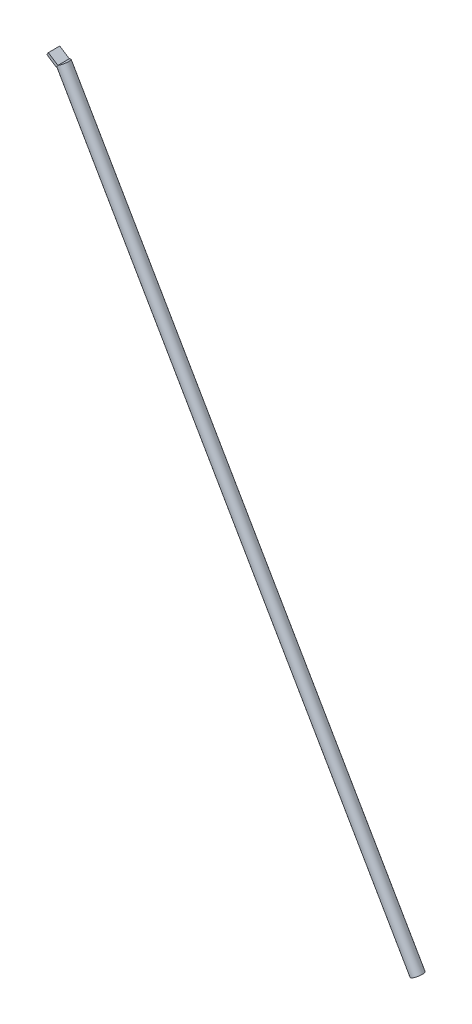
ISO-10303-21;
HEADER;
FILE_DESCRIPTION(('STEP AP214'),'2;1');
FILE_NAME('part.step','',(''),(''),'','','');
FILE_SCHEMA(('AUTOMOTIVE_DESIGN { 1 0 10303 214 1 1 1 1 }'));
ENDSEC;
DATA;
#1=APPLICATION_CONTEXT('core data for automotive mechanical design processes');
#2=APPLICATION_PROTOCOL_DEFINITION('international standard','automotive_design',2000,#1);
#3=PRODUCT_CONTEXT('',#1,'mechanical');
#4=PRODUCT('Part','Part','',(#3));
#5=PRODUCT_RELATED_PRODUCT_CATEGORY('part','',(#4));
#6=PRODUCT_DEFINITION_FORMATION('','',#4);
#7=PRODUCT_DEFINITION_CONTEXT('part definition',#1,'design');
#8=PRODUCT_DEFINITION('design','',#6,#7);
#9=PRODUCT_DEFINITION_SHAPE('','',#8);
#10=(LENGTH_UNIT() NAMED_UNIT(*) SI_UNIT(.MILLI.,.METRE.));
#11=(NAMED_UNIT(*) PLANE_ANGLE_UNIT() SI_UNIT($,.RADIAN.));
#12=(NAMED_UNIT(*) SI_UNIT($,.STERADIAN.) SOLID_ANGLE_UNIT());
#13=UNCERTAINTY_MEASURE_WITH_UNIT(LENGTH_MEASURE(1.E-05),#10,'distance_accuracy_value','');
#14=(GEOMETRIC_REPRESENTATION_CONTEXT(3) GLOBAL_UNCERTAINTY_ASSIGNED_CONTEXT((#13)) GLOBAL_UNIT_ASSIGNED_CONTEXT((#10,
#11,#12)) REPRESENTATION_CONTEXT('',''));
#15=CARTESIAN_POINT('',(0.,0.,0.));
#16=DIRECTION('',(0.,0.,1.));
#17=DIRECTION('',(1.,0.,0.));
#18=AXIS2_PLACEMENT_3D('',#15,#16,#17);
#19=CARTESIAN_POINT('',(-2.75531719823761,-4.1723167589597,20.));
#20=DIRECTION('',(-0.834463351791941,0.551063439647523,0.));
#21=DIRECTION('',(-0.551063439647523,-0.834463351791941,0.));
#22=AXIS2_PLACEMENT_3D('',#19,#20,#21);
#23=PLANE('',#22);
#24=CARTESIAN_POINT('',(1.11022302462516E-13,0.,10.));
#25=DIRECTION('',(-0.834463351791941,0.551063439647523,0.));
#26=DIRECTION('',(0.551063439647523,0.834463351791941,0.));
#27=AXIS2_PLACEMENT_3D('',#24,#25,#26);
#28=ELLIPSE('',#27,11.1798471251224,10.);
#29=CARTESIAN_POINT('',(0.,0.,20.));
#30=VERTEX_POINT('',#29);
#31=CARTESIAN_POINT('',(-2.75531719823761,-4.1723167589597,18.944173350465));
#32=VERTEX_POINT('',#31);
#33=EDGE_CURVE('E98',#30,#32,#28,.F.);
#34=ORIENTED_EDGE('',*,*,#33,.F.);
#35=DIRECTION('',(0.551063439647523,0.834463351791941,0.));
#36=VECTOR('',#35,1.);
#37=CARTESIAN_POINT('',(-2.75531719823761,-4.1723167589597,20.));
#38=LINE('',#37,#36);
#39=CARTESIAN_POINT('',(-2.75531719823761,-4.1723167589597,20.));
#40=VERTEX_POINT('',#39);
#41=EDGE_CURVE('E122',#40,#30,#38,.T.);
#42=ORIENTED_EDGE('',*,*,#41,.F.);
#43=DIRECTION('',(0.,0.,-1.));
#44=VECTOR('',#43,1.);
#45=CARTESIAN_POINT('',(-2.75531719823761,-4.1723167589597,20.));
#46=LINE('',#45,#44);
#47=EDGE_CURVE('E148',#40,#32,#46,.T.);
#48=ORIENTED_EDGE('',*,*,#47,.T.);
#49=EDGE_LOOP('',(#34,#42,#48));
#50=FACE_BOUND('',#49,.T.);
#51=ADVANCED_FACE('F39',(#50),#23,.F.);
#52=CARTESIAN_POINT('',(-2.75531719823761,-4.1723167589597,1.05582664953504));
#53=VERTEX_POINT('',#52);
#54=CARTESIAN_POINT('',(0.,0.,0.));
#55=VERTEX_POINT('',#54);
#56=EDGE_CURVE('E62',#53,#55,#28,.F.);
#57=ORIENTED_EDGE('',*,*,#56,.F.);
#58=CARTESIAN_POINT('',(-2.75531719823761,-4.1723167589597,0.));
#59=VERTEX_POINT('',#58);
#60=EDGE_CURVE('E94',#53,#59,#46,.T.);
#61=ORIENTED_EDGE('',*,*,#60,.T.);
#62=DIRECTION('',(0.551063439647523,0.834463351791941,0.));
#63=VECTOR('',#62,1.);
#64=CARTESIAN_POINT('',(-2.75531719823761,-4.1723167589597,0.));
#65=LINE('',#64,#63);
#66=EDGE_CURVE('E136',#59,#55,#65,.T.);
#67=ORIENTED_EDGE('',*,*,#66,.T.);
#68=EDGE_LOOP('',(#57,#61,#67));
#69=FACE_BOUND('',#68,.T.);
#70=ADVANCED_FACE('F177',(#69),#23,.F.);
#71=CARTESIAN_POINT('',(-11.099950716157,1.33831763751553,20.));
#72=DIRECTION('',(0.551063439647523,0.834463351791941,0.));
#73=DIRECTION('',(-0.834463351791941,0.551063439647523,0.));
#74=AXIS2_PLACEMENT_3D('',#71,#72,#73);
#75=PLANE('',#74);
#76=CARTESIAN_POINT('',(5.59115579438785,-9.68416590891286,10.));
#77=DIRECTION('',(0.551063439647523,0.834463351791941,0.));
#78=DIRECTION('',(-0.834463351791941,0.551063439647523,0.));
#79=AXIS2_PLACEMENT_3D('',#76,#77,#78);
#80=ELLIPSE('',#79,22.3646231775507,10.);
#81=CARTESIAN_POINT('',(-4.84101581039121,-2.79496178128059,1.70827191927261));
#82=VERTEX_POINT('',#81);
#83=EDGE_CURVE('E91',#82,#53,#80,.F.);
#84=ORIENTED_EDGE('',*,*,#83,.F.);
#85=DIRECTION('',(0.,0.,-1.));
#86=VECTOR('',#85,1.);
#87=CARTESIAN_POINT('',(-4.84101581039121,-2.79496178128059,20.));
#88=LINE('',#87,#86);
#89=CARTESIAN_POINT('',(-4.84101581039121,-2.79496178128059,18.2917280807274));
#90=VERTEX_POINT('',#89);
#91=EDGE_CURVE('E54',#90,#82,#88,.T.);
#92=ORIENTED_EDGE('',*,*,#91,.F.);
#93=EDGE_CURVE('E100',#32,#90,#80,.F.);
#94=ORIENTED_EDGE('',*,*,#93,.F.);
#95=ORIENTED_EDGE('',*,*,#47,.F.);
#96=DIRECTION('',(0.834463351791941,-0.551063439647524,0.));
#97=VECTOR('',#96,1.);
#98=CARTESIAN_POINT('',(-19.4445842340764,6.84895203399077,20.));
#99=LINE('',#98,#97);
#100=CARTESIAN_POINT('',(-19.4445842340764,6.84895203399077,20.));
#101=VERTEX_POINT('',#100);
#102=EDGE_CURVE('E133',#101,#40,#99,.T.);
#103=ORIENTED_EDGE('',*,*,#102,.F.);
#104=DIRECTION('',(0.,0.,-1.));
#105=VECTOR('',#104,1.);
#106=CARTESIAN_POINT('',(-19.4445842340764,6.84895203399077,20.));
#107=LINE('',#106,#105);
#108=CARTESIAN_POINT('',(-19.4445842340764,6.84895203399077,0.));
#109=VERTEX_POINT('',#108);
#110=EDGE_CURVE('E152',#101,#109,#107,.T.);
#111=ORIENTED_EDGE('',*,*,#110,.T.);
#112=DIRECTION('',(0.834463351791941,-0.551063439647523,0.));
#113=VECTOR('',#112,1.);
#114=CARTESIAN_POINT('',(-11.099950716157,1.33831763751553,0.));
#115=LINE('',#114,#113);
#116=EDGE_CURVE('E127',#109,#59,#115,.T.);
#117=ORIENTED_EDGE('',*,*,#116,.T.);
#118=ORIENTED_EDGE('',*,*,#60,.F.);
#119=EDGE_LOOP('',(#84,#92,#94,#95,#103,#111,#117,#118));
#120=FACE_BOUND('',#119,.T.);
#121=ADVANCED_FACE('F92',(#120),#75,.F.);
#122=CARTESIAN_POINT('',(0.,0.,20.));
#123=DIRECTION('',(-0.551063439647524,-0.834463351791941,0.));
#124=DIRECTION('',(0.834463351791941,-0.551063439647524,0.));
#125=AXIS2_PLACEMENT_3D('',#122,#123,#124);
#126=PLANE('',#125);
#127=DIRECTION('',(-0.834463351791941,0.551063439647524,0.));
#128=VECTOR('',#127,1.);
#129=CARTESIAN_POINT('',(0.,0.,0.));
#130=LINE('',#129,#128);
#131=CARTESIAN_POINT('',(-16.6892670358388,11.0212687929505,0.));
#132=VERTEX_POINT('',#131);
#133=EDGE_CURVE('E139',#55,#132,#130,.T.);
#134=ORIENTED_EDGE('',*,*,#133,.T.);
#135=DIRECTION('',(0.,0.,-1.));
#136=VECTOR('',#135,1.);
#137=CARTESIAN_POINT('',(-16.6892670358388,11.0212687929505,20.));
#138=LINE('',#137,#136);
#139=CARTESIAN_POINT('',(-16.6892670358388,11.0212687929505,20.));
#140=VERTEX_POINT('',#139);
#141=EDGE_CURVE('E47',#140,#132,#138,.T.);
#142=ORIENTED_EDGE('',*,*,#141,.F.);
#143=DIRECTION('',(-0.834463351791941,0.551063439647524,0.));
#144=VECTOR('',#143,1.);
#145=CARTESIAN_POINT('',(0.,0.,20.));
#146=LINE('',#145,#144);
#147=EDGE_CURVE('E126',#30,#140,#146,.T.);
#148=ORIENTED_EDGE('',*,*,#147,.F.);
#149=DIRECTION('',(0.,0.,-1.));
#150=VECTOR('',#149,1.);
#151=CARTESIAN_POINT('',(0.,0.,20.));
#152=LINE('',#151,#150);
#153=EDGE_CURVE('E11',#30,#55,#152,.T.);
#154=ORIENTED_EDGE('',*,*,#153,.T.);
#155=EDGE_LOOP('',(#134,#142,#148,#154));
#156=FACE_BOUND('',#155,.T.);
#157=ADVANCED_FACE('F174',(#156),#126,.F.);
#158=CARTESIAN_POINT('',(-16.6892670358388,11.0212687929505,20.));
#159=DIRECTION('',(0.834463351791941,-0.551063439647524,0.));
#160=DIRECTION('',(0.551063439647524,0.834463351791941,0.));
#161=AXIS2_PLACEMENT_3D('',#158,#159,#160);
#162=PLANE('',#161);
#163=DIRECTION('',(-0.551063439647524,-0.834463351791941,0.));
#164=VECTOR('',#163,1.);
#165=CARTESIAN_POINT('',(-16.6892670358388,11.0212687929505,0.));
#166=LINE('',#165,#164);
#167=EDGE_CURVE('E142',#132,#109,#166,.T.);
#168=ORIENTED_EDGE('',*,*,#167,.T.);
#169=ORIENTED_EDGE('',*,*,#110,.F.);
#170=DIRECTION('',(-0.551063439647524,-0.834463351791941,0.));
#171=VECTOR('',#170,1.);
#172=CARTESIAN_POINT('',(-16.6892670358388,11.0212687929505,20.));
#173=LINE('',#172,#171);
#174=EDGE_CURVE('E130',#140,#101,#173,.T.);
#175=ORIENTED_EDGE('',*,*,#174,.F.);
#176=ORIENTED_EDGE('',*,*,#141,.T.);
#177=EDGE_LOOP('',(#168,#169,#175,#176));
#178=FACE_BOUND('',#177,.T.);
#179=ADVANCED_FACE('F161',(#178),#162,.F.);
#180=CARTESIAN_POINT('',(0.,0.,20.));
#181=DIRECTION('',(0.,0.,1.));
#182=DIRECTION('',(1.,0.,0.));
#183=AXIS2_PLACEMENT_3D('',#180,#181,#182);
#184=PLANE('',#183);
#185=ORIENTED_EDGE('',*,*,#41,.T.);
#186=ORIENTED_EDGE('',*,*,#147,.T.);
#187=ORIENTED_EDGE('',*,*,#174,.T.);
#188=ORIENTED_EDGE('',*,*,#102,.T.);
#189=EDGE_LOOP('',(#185,#186,#187,#188));
#190=FACE_BOUND('',#189,.T.);
#191=ADVANCED_FACE('F172',(#190),#184,.T.);
#192=CARTESIAN_POINT('',(0.,0.,0.));
#193=DIRECTION('',(0.,0.,1.));
#194=DIRECTION('',(1.,0.,0.));
#195=AXIS2_PLACEMENT_3D('',#192,#193,#194);
#196=PLANE('',#195);
#197=ORIENTED_EDGE('',*,*,#66,.F.);
#198=ORIENTED_EDGE('',*,*,#116,.F.);
#199=ORIENTED_EDGE('',*,*,#167,.F.);
#200=ORIENTED_EDGE('',*,*,#133,.F.);
#201=EDGE_LOOP('',(#197,#198,#199,#200));
#202=FACE_BOUND('',#201,.T.);
#203=ADVANCED_FACE('F167',(#202),#196,.F.);
#204=CARTESIAN_POINT('',(619.999999999998,-1073.87150069271,10.));
#205=DIRECTION('',(-0.499999999999999,0.86602540378444,0.));
#206=DIRECTION('',(-0.866025403784439,-0.499999999999998,0.));
#207=AXIS2_PLACEMENT_3D('',#204,#205,#206);
#208=CYLINDRICAL_SURFACE('',#207,10.);
#209=CARTESIAN_POINT('',(619.999999999998,-1073.87150069271,10.));
#210=DIRECTION('',(0.499999999999999,-0.86602540378444,0.));
#211=DIRECTION('',(0.86602540378444,0.499999999999999,0.));
#212=AXIS2_PLACEMENT_3D('',#209,#210,#211);
#213=CIRCLE('',#212,10.);
#214=CARTESIAN_POINT('',(628.660254037842,-1068.87150069271,10.));
#215=VERTEX_POINT('',#214);
#216=EDGE_CURVE('E106',#215,#215,#213,.T.);
#217=ORIENTED_EDGE('',*,*,#216,.F.);
#218=EDGE_LOOP('',(#217));
#219=FACE_BOUND('',#218,.T.);
#220=ORIENTED_EDGE('',*,*,#83,.T.);
#221=ORIENTED_EDGE('',*,*,#56,.T.);
#222=CARTESIAN_POINT('',(0.,0.,10.));
#223=DIRECTION('',(0.499999999999999,-0.86602540378444,0.));
#224=DIRECTION('',(0.86602540378444,0.499999999999999,0.));
#225=AXIS2_PLACEMENT_3D('',#222,#223,#224);
#226=CIRCLE('',#225,10.);
#227=EDGE_CURVE('E111',#55,#30,#226,.T.);
#228=ORIENTED_EDGE('',*,*,#227,.T.);
#229=ORIENTED_EDGE('',*,*,#33,.T.);
#230=ORIENTED_EDGE('',*,*,#93,.T.);
#231=EDGE_CURVE('E104',#90,#82,#226,.T.);
#232=ORIENTED_EDGE('',*,*,#231,.T.);
#233=EDGE_LOOP('',(#220,#221,#228,#229,#230,#232));
#234=FACE_BOUND('',#233,.T.);
#235=ADVANCED_FACE('F108',(#219,#234),#208,.T.);
#236=CARTESIAN_POINT('',(0.,0.,10.));
#237=DIRECTION('',(0.499999999999999,-0.86602540378444,0.));
#238=DIRECTION('',(0.86602540378444,0.499999999999999,0.));
#239=AXIS2_PLACEMENT_3D('',#236,#237,#238);
#240=PLANE('',#239);
#241=ORIENTED_EDGE('',*,*,#227,.F.);
#242=ORIENTED_EDGE('',*,*,#153,.F.);
#243=EDGE_LOOP('',(#241,#242));
#244=FACE_BOUND('',#243,.T.);
#245=ADVANCED_FACE('F179',(#244),#240,.F.);
#246=ORIENTED_EDGE('',*,*,#231,.F.);
#247=ORIENTED_EDGE('',*,*,#91,.T.);
#248=EDGE_LOOP('',(#246,#247));
#249=FACE_BOUND('',#248,.T.);
#250=ADVANCED_FACE('F103',(#249),#240,.F.);
#251=CARTESIAN_POINT('',(619.999999999998,-1073.87150069271,10.));
#252=DIRECTION('',(0.499999999999999,-0.86602540378444,0.));
#253=DIRECTION('',(0.86602540378444,0.499999999999999,0.));
#254=AXIS2_PLACEMENT_3D('',#251,#252,#253);
#255=PLANE('',#254);
#256=ORIENTED_EDGE('',*,*,#216,.T.);
#257=EDGE_LOOP('',(#256));
#258=FACE_BOUND('',#257,.T.);
#259=ADVANCED_FACE('F186',(#258),#255,.T.);
#260=CLOSED_SHELL('',(#51,#70,#121,#157,#179,#191,#203,#235,#245,#250,#259));
#261=MANIFOLD_SOLID_BREP('B2',#260);
#262=ADVANCED_BREP_SHAPE_REPRESENTATION('',(#18,#261),#14);
#263=SHAPE_DEFINITION_REPRESENTATION(#9,#262);
ENDSEC;
END-ISO-10303-21;
